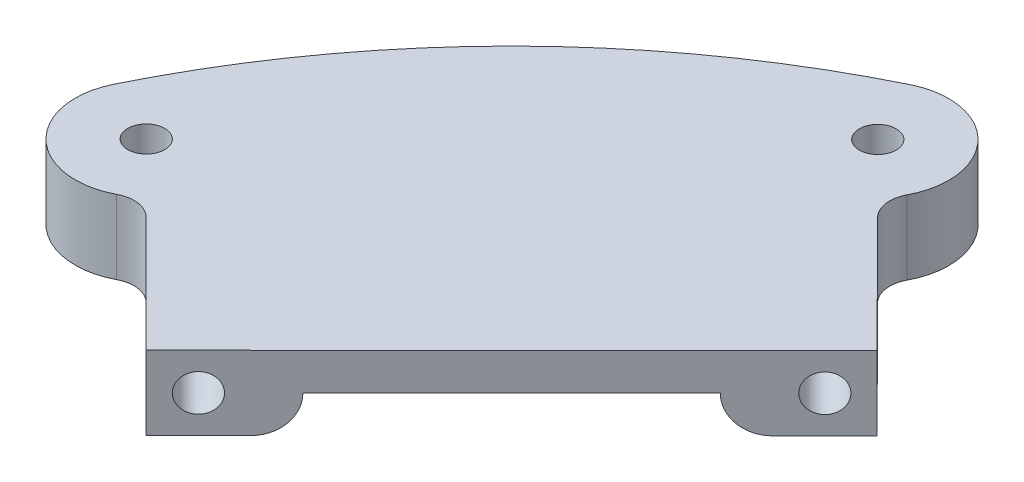
ISO-10303-21;
HEADER;
FILE_DESCRIPTION(('STEP AP214'),'2;1');
FILE_NAME('part.step','',(''),(''),'','','');
FILE_SCHEMA(('AUTOMOTIVE_DESIGN { 1 0 10303 214 1 1 1 1 }'));
ENDSEC;
DATA;
#1=APPLICATION_CONTEXT('core data for automotive mechanical design processes');
#2=APPLICATION_PROTOCOL_DEFINITION('international standard','automotive_design',2000,#1);
#3=PRODUCT_CONTEXT('',#1,'mechanical');
#4=PRODUCT('Part','Part','',(#3));
#5=PRODUCT_RELATED_PRODUCT_CATEGORY('part','',(#4));
#6=PRODUCT_DEFINITION_FORMATION('','',#4);
#7=PRODUCT_DEFINITION_CONTEXT('part definition',#1,'design');
#8=PRODUCT_DEFINITION('design','',#6,#7);
#9=PRODUCT_DEFINITION_SHAPE('','',#8);
#10=(LENGTH_UNIT() NAMED_UNIT(*) SI_UNIT(.MILLI.,.METRE.));
#11=(NAMED_UNIT(*) PLANE_ANGLE_UNIT() SI_UNIT($,.RADIAN.));
#12=(NAMED_UNIT(*) SI_UNIT($,.STERADIAN.) SOLID_ANGLE_UNIT());
#13=UNCERTAINTY_MEASURE_WITH_UNIT(LENGTH_MEASURE(1.E-05),#10,'distance_accuracy_value','');
#14=(GEOMETRIC_REPRESENTATION_CONTEXT(3) GLOBAL_UNCERTAINTY_ASSIGNED_CONTEXT((#13)) GLOBAL_UNIT_ASSIGNED_CONTEXT((#10,
#11,#12)) REPRESENTATION_CONTEXT('',''));
#15=CARTESIAN_POINT('',(0.,0.,0.));
#16=DIRECTION('',(0.,0.,1.));
#17=DIRECTION('',(1.,0.,0.));
#18=AXIS2_PLACEMENT_3D('',#15,#16,#17);
#19=CARTESIAN_POINT('',(-7.54395283776638,12.7,5.9740681448001));
#20=DIRECTION('',(-0.706369472249059,0.,-0.707843322123326));
#21=DIRECTION('',(-0.707843322123326,0.,0.706369472249059));
#22=AXIS2_PLACEMENT_3D('',#19,#20,#21);
#23=PLANE('',#22);
#24=CARTESIAN_POINT('',(-61.4301468246346,6.35,59.7480619346049));
#25=DIRECTION('',(0.706369472249059,0.,0.707843322123325));
#26=DIRECTION('',(0.707843322123326,0.,-0.706369472249059));
#27=AXIS2_PLACEMENT_3D('',#24,#25,#26);
#28=CIRCLE('',#27,6.35);
#29=CARTESIAN_POINT('',(-61.4301468246346,0.,59.7480619346049));
#30=VERTEX_POINT('',#29);
#31=CARTESIAN_POINT('',(-56.9353417291515,6.35,55.2626157858234));
#32=VERTEX_POINT('',#31);
#33=EDGE_CURVE('E339',#30,#32,#28,.T.);
#34=ORIENTED_EDGE('',*,*,#33,.T.);
#35=DIRECTION('',(0.707843322123326,0.,-0.706369472249059));
#36=VECTOR('',#35,1.);
#37=CARTESIAN_POINT('',(-0.777086763688398,6.35,-0.778708166189429));
#38=LINE('',#37,#36);
#39=CARTESIAN_POINT('',(-21.0283681242157,6.35,19.4304065911447));
#40=VERTEX_POINT('',#39);
#41=EDGE_CURVE('E174',#32,#40,#38,.T.);
#42=ORIENTED_EDGE('',*,*,#41,.T.);
#43=CARTESIAN_POINT('',(-16.5335630287326,6.35,14.9449604423631));
#44=DIRECTION('',(0.706369472249059,0.,0.707843322123325));
#45=DIRECTION('',(0.707843322123326,0.,-0.706369472249059));
#46=AXIS2_PLACEMENT_3D('',#43,#44,#45);
#47=CIRCLE('',#46,6.35);
#48=CARTESIAN_POINT('',(-16.5335630287326,0.,14.9449604423631));
#49=VERTEX_POINT('',#48);
#50=EDGE_CURVE('E157',#49,#40,#47,.F.);
#51=ORIENTED_EDGE('',*,*,#50,.F.);
#52=DIRECTION('',(0.707843322123326,0.,-0.706369472249059));
#53=VECTOR('',#52,1.);
#54=CARTESIAN_POINT('',(-7.54395283776638,0.,5.9740681448001));
#55=LINE('',#54,#53);
#56=CARTESIAN_POINT('',(-7.54395283776638,0.,5.9740681448001));
#57=VERTEX_POINT('',#56);
#58=EDGE_CURVE('E171',#49,#57,#55,.T.);
#59=ORIENTED_EDGE('',*,*,#58,.T.);
#60=DIRECTION('',(0.,-1.,0.));
#61=VECTOR('',#60,1.);
#62=CARTESIAN_POINT('',(-7.54395283776638,12.7,5.9740681448001));
#63=LINE('',#62,#61);
#64=CARTESIAN_POINT('',(-7.54395283776638,12.7,5.9740681448001));
#65=VERTEX_POINT('',#64);
#66=EDGE_CURVE('E229',#65,#57,#63,.T.);
#67=ORIENTED_EDGE('',*,*,#66,.F.);
#68=DIRECTION('',(0.707843322123326,0.,-0.706369472249059));
#69=VECTOR('',#68,1.);
#70=CARTESIAN_POINT('',(-7.54395283776638,12.7,5.9740681448001));
#71=LINE('',#70,#69);
#72=CARTESIAN_POINT('',(-70.4197570156008,12.7,68.718954232168));
#73=VERTEX_POINT('',#72);
#74=EDGE_CURVE('E396',#73,#65,#71,.T.);
#75=ORIENTED_EDGE('',*,*,#74,.F.);
#76=DIRECTION('',(0.,-1.,0.));
#77=VECTOR('',#76,1.);
#78=CARTESIAN_POINT('',(-70.4197570156008,12.7,68.718954232168));
#79=LINE('',#78,#77);
#80=CARTESIAN_POINT('',(-70.4197570156008,0.,68.718954232168));
#81=VERTEX_POINT('',#80);
#82=EDGE_CURVE('E232',#73,#81,#79,.T.);
#83=ORIENTED_EDGE('',*,*,#82,.T.);
#84=EDGE_CURVE('E183',#81,#30,#55,.T.);
#85=ORIENTED_EDGE('',*,*,#84,.T.);
#86=EDGE_LOOP('',(#34,#42,#51,#59,#67,#75,#83,#85));
#87=FACE_BOUND('',#86,.T.);
#88=CARTESIAN_POINT('',(-12.0387579332495,6.35,10.4595142935816));
#89=DIRECTION('',(-0.706369472249059,0.,-0.707843322123326));
#90=DIRECTION('',(-0.707843322123326,0.,0.706369472249059));
#91=AXIS2_PLACEMENT_3D('',#88,#89,#90);
#92=CIRCLE('',#91,3.175);
#93=CARTESIAN_POINT('',(-14.286160480991,6.35,12.7022373679724));
#94=VERTEX_POINT('',#93);
#95=EDGE_CURVE('E364',#94,#94,#92,.T.);
#96=ORIENTED_EDGE('',*,*,#95,.T.);
#97=EDGE_LOOP('',(#96));
#98=FACE_BOUND('',#97,.T.);
#99=CARTESIAN_POINT('',(-65.9249519201177,6.35,64.2335080833864));
#100=DIRECTION('',(0.706369472249059,0.,0.707843322123325));
#101=DIRECTION('',(0.707843322123326,0.,-0.706369472249059));
#102=AXIS2_PLACEMENT_3D('',#99,#100,#101);
#103=CIRCLE('',#102,3.175);
#104=CARTESIAN_POINT('',(-63.6775493723762,6.35,61.9907850089957));
#105=VERTEX_POINT('',#104);
#106=EDGE_CURVE('E360',#105,#105,#103,.T.);
#107=ORIENTED_EDGE('',*,*,#106,.F.);
#108=EDGE_LOOP('',(#107));
#109=FACE_BOUND('',#108,.T.);
#110=ADVANCED_FACE('F38',(#87,#98,#109),#23,.F.);
#111=CARTESIAN_POINT('',(-101.843613636536,12.7,37.2809985615729));
#112=DIRECTION('',(0.,1.,0.));
#113=DIRECTION('',(0.,0.,1.));
#114=AXIS2_PLACEMENT_3D('',#111,#112,#113);
#115=PLANE('',#114);
#116=CARTESIAN_POINT('',(-101.843613636536,12.7,37.2809985615729));
#117=DIRECTION('',(0.,1.,0.));
#118=DIRECTION('',(0.,0.,1.));
#119=AXIS2_PLACEMENT_3D('',#116,#117,#118);
#120=CIRCLE('',#119,3.17500000000014);
#121=CARTESIAN_POINT('',(-101.843613636536,12.7,40.455998561573));
#122=VERTEX_POINT('',#121);
#123=EDGE_CURVE('E379',#122,#122,#120,.T.);
#124=ORIENTED_EDGE('',*,*,#123,.F.);
#125=EDGE_LOOP('',(#124));
#126=FACE_BOUND('',#125,.T.);
#127=CARTESIAN_POINT('',(-101.843613636536,12.7,37.2809985615729));
#128=DIRECTION('',(0.,1.,0.));
#129=DIRECTION('',(0.,0.,1.));
#130=AXIS2_PLACEMENT_3D('',#127,#128,#129);
#131=CIRCLE('',#130,12.1889368392396);
#132=CARTESIAN_POINT('',(-112.854196124688,12.7,32.0524945171473));
#133=VERTEX_POINT('',#132);
#134=CARTESIAN_POINT('',(-96.1439027407809,12.7,48.0552028002061));
#135=VERTEX_POINT('',#134);
#136=EDGE_CURVE('E207',#133,#135,#131,.T.);
#137=ORIENTED_EDGE('',*,*,#136,.T.);
#138=CARTESIAN_POINT('',(-93.7684263778857,12.7,52.5455827450801));
#139=DIRECTION('',(0.,-1.,0.));
#140=DIRECTION('',(0.,0.,-1.));
#141=AXIS2_PLACEMENT_3D('',#138,#139,#140);
#142=CIRCLE('',#141,5.08000000000004);
#143=CARTESIAN_POINT('',(-90.1755144575095,12.7,48.9542899510546));
#144=VERTEX_POINT('',#143);
#145=EDGE_CURVE('E390',#135,#144,#142,.T.);
#146=ORIENTED_EDGE('',*,*,#145,.T.);
#147=DIRECTION('',(0.706947400398703,0.,0.707266126058301));
#148=VECTOR('',#147,1.);
#149=CARTESIAN_POINT('',(-90.1755144575095,12.7,48.9542899510546));
#150=LINE('',#149,#148);
#151=EDGE_CURVE('E393',#144,#73,#150,.T.);
#152=ORIENTED_EDGE('',*,*,#151,.T.);
#153=ORIENTED_EDGE('',*,*,#74,.T.);
#154=DIRECTION('',(-0.705791072840609,0.,-0.708420045946261));
#155=VECTOR('',#154,1.);
#156=CARTESIAN_POINT('',(-27.2673965223174,12.7,-13.8228426109464));
#157=LINE('',#156,#155);
#158=CARTESIAN_POINT('',(-27.2673965223174,12.7,-13.8228426109464));
#159=VERTEX_POINT('',#158);
#160=EDGE_CURVE('E399',#65,#159,#157,.T.);
#161=ORIENTED_EDGE('',*,*,#160,.T.);
#162=CARTESIAN_POINT('',(-23.6686226889104,12.7,-17.4082612609767));
#163=DIRECTION('',(0.,-1.,0.));
#164=DIRECTION('',(0.,0.,1.));
#165=AXIS2_PLACEMENT_3D('',#162,#163,#164);
#166=CIRCLE('',#165,5.07999999999999);
#167=CARTESIAN_POINT('',(-28.1540415855256,12.7,-19.7930919304138));
#168=VERTEX_POINT('',#167);
#169=EDGE_CURVE('E402',#159,#168,#166,.T.);
#170=ORIENTED_EDGE('',*,*,#169,.T.);
#171=CARTESIAN_POINT('',(-38.9163422997725,12.7,-25.5152475213685));
#172=DIRECTION('',(0.,1.,0.));
#173=DIRECTION('',(0.,0.,-1.));
#174=AXIS2_PLACEMENT_3D('',#171,#172,#173);
#175=CIRCLE('',#174,12.1889368392396);
#176=CARTESIAN_POINT('',(-44.1218852183505,12.7,-36.5367040582249));
#177=VERTEX_POINT('',#176);
#178=EDGE_CURVE('E405',#168,#177,#175,.T.);
#179=ORIENTED_EDGE('',*,*,#178,.T.);
#180=CARTESIAN_POINT('',(21.1376983967457,12.7,97.6619821178486));
#181=DIRECTION('',(0.,1.,0.));
#182=DIRECTION('',(0.,0.,-1.));
#183=AXIS2_PLACEMENT_3D('',#180,#181,#182);
#184=CIRCLE('',#183,149.225);
#185=CARTESIAN_POINT('',(-84.2350416557578,12.7,-8.00109695345003));
#186=VERTEX_POINT('',#185);
#187=EDGE_CURVE('E408',#177,#186,#184,.T.);
#188=ORIENTED_EDGE('',*,*,#187,.T.);
#189=CARTESIAN_POINT('',(21.2081755529898,12.7,97.5916517069995));
#190=DIRECTION('',(0.,1.,0.));
#191=DIRECTION('',(0.,0.,1.));
#192=AXIS2_PLACEMENT_3D('',#189,#190,#191);
#193=CIRCLE('',#192,149.225);
#194=EDGE_CURVE('E213',#186,#133,#193,.T.);
#195=ORIENTED_EDGE('',*,*,#194,.T.);
#196=EDGE_LOOP('',(#137,#146,#152,#153,#161,#170,#179,#188,#195));
#197=FACE_BOUND('',#196,.T.);
#198=CARTESIAN_POINT('',(-38.9163422997725,12.7,-25.5152475213685));
#199=DIRECTION('',(0.,1.,0.));
#200=DIRECTION('',(0.,0.,-1.));
#201=AXIS2_PLACEMENT_3D('',#198,#199,#200);
#202=CIRCLE('',#201,3.17500000001043);
#203=CARTESIAN_POINT('',(-38.9163422997725,12.7,-28.6902475213789));
#204=VERTEX_POINT('',#203);
#205=EDGE_CURVE('E371',#204,#204,#202,.T.);
#206=ORIENTED_EDGE('',*,*,#205,.F.);
#207=EDGE_LOOP('',(#206));
#208=FACE_BOUND('',#207,.T.);
#209=ADVANCED_FACE('F278',(#126,#197,#208),#115,.T.);
#210=CARTESIAN_POINT('',(-101.843613636536,0.,37.2809985615729));
#211=DIRECTION('',(0.,1.,0.));
#212=DIRECTION('',(0.,0.,1.));
#213=AXIS2_PLACEMENT_3D('',#210,#211,#212);
#214=PLANE('',#213);
#215=DIRECTION('',(0.707843322123326,0.,-0.706369472249059));
#216=VECTOR('',#215,1.);
#217=CARTESIAN_POINT('',(-36.6606559539406,0.,-36.7371489300544));
#218=LINE('',#217,#216);
#219=CARTESIAN_POINT('',(-92.2883711453305,0.,18.7747399216949));
#220=VERTEX_POINT('',#219);
#221=CARTESIAN_POINT('',(-57.4424770885411,0.,-15.9985990724567));
#222=VERTEX_POINT('',#221);
#223=EDGE_CURVE('E165',#220,#222,#218,.T.);
#224=ORIENTED_EDGE('',*,*,#223,.F.);
#225=CARTESIAN_POINT('',(-92.2883711453305,0.,18.7747399216949));
#226=CARTESIAN_POINT('',(-92.4218469027018,0.,18.9079607344967));
#227=CARTESIAN_POINT('',(-92.5485967866194,0.,19.0476025305012));
#228=CARTESIAN_POINT('',(-92.7889904489911,0.,19.3373076905955));
#229=CARTESIAN_POINT('',(-92.9026598681083,0.,19.4873497092292));
#230=CARTESIAN_POINT('',(-93.2217112059064,0.,19.9451236542563));
#231=CARTESIAN_POINT('',(-93.4095579795355,0.,20.2651113442281));
#232=CARTESIAN_POINT('',(-93.7600622221624,0.,20.9566332135837));
#233=CARTESIAN_POINT('',(-93.9186232147493,0.,21.3301751730085));
#234=CARTESIAN_POINT('',(-94.1972071470198,0.,22.0915645610845));
#235=CARTESIAN_POINT('',(-94.3171719588188,0.,22.4794325953181));
#236=CARTESIAN_POINT('',(-94.5300370984474,0.,23.2660027307276));
#237=CARTESIAN_POINT('',(-94.622682678036,0.,23.6647711114443));
#238=CARTESIAN_POINT('',(-94.7904172252263,0.,24.4656298052867));
#239=CARTESIAN_POINT('',(-94.8655140843054,0.,24.8677185407353));
#240=CARTESIAN_POINT('',(-94.9817951703179,0.,25.5205420231663));
#241=CARTESIAN_POINT('',(-95.0250517553798,0.,25.7709265747916));
#242=CARTESIAN_POINT('',(-95.0691853333359,0.,26.0265536911415));
#243=CARTESIAN_POINT('',(-95.0700891369479,0.,26.0317887041317));
#244=CARTESIAN_POINT('',(-95.0709929404961,0.,26.0370237184815));
#245=B_SPLINE_CURVE_WITH_KNOTS('',3,(#225,#226,#227,#228,#229,#230,#231,#232,#233,#234,#235,
#236,#237,#238,#239,#240,#241,#242,#243,#244),.UNSPECIFIED.,.F.,.F.,(4,2,2,2,2,2,2,2,2,4),(0.,
0.565172013320262,1.12921657797543,2.23838440307382,3.45307205526979,4.66958061942638,
5.89709813848719,7.12406258880606,7.88635220286167,7.90228958031221),.UNSPECIFIED.);
#246=CARTESIAN_POINT('',(-95.0709929404961,0.,26.0370237184815));
#247=VERTEX_POINT('',#246);
#248=EDGE_CURVE('E11',#220,#247,#245,.T.);
#249=ORIENTED_EDGE('',*,*,#248,.T.);
#250=DIRECTION('',(0.706369472249059,0.,0.707843322123326));
#251=VECTOR('',#250,1.);
#252=CARTESIAN_POINT('',(-97.3137160148868,0.,23.78962117074));
#253=LINE('',#252,#251);
#254=EDGE_CURVE('E346',#247,#30,#253,.T.);
#255=ORIENTED_EDGE('',*,*,#254,.T.);
#256=ORIENTED_EDGE('',*,*,#84,.F.);
#257=DIRECTION('',(0.706947400398703,0.,0.707266126058301));
#258=VECTOR('',#257,1.);
#259=CARTESIAN_POINT('',(-90.1755144575095,0.,48.9542899510546));
#260=LINE('',#259,#258);
#261=CARTESIAN_POINT('',(-90.1755144575095,0.,48.9542899510546));
#262=VERTEX_POINT('',#261);
#263=EDGE_CURVE('E184',#262,#81,#260,.T.);
#264=ORIENTED_EDGE('',*,*,#263,.F.);
#265=CARTESIAN_POINT('',(-93.7684263778857,0.,52.5455827450801));
#266=DIRECTION('',(0.,-1.,0.));
#267=DIRECTION('',(0.,0.,-1.));
#268=AXIS2_PLACEMENT_3D('',#265,#266,#267);
#269=CIRCLE('',#268,5.08000000000004);
#270=CARTESIAN_POINT('',(-96.1439027407809,0.,48.0552028002061));
#271=VERTEX_POINT('',#270);
#272=EDGE_CURVE('E189',#271,#262,#269,.T.);
#273=ORIENTED_EDGE('',*,*,#272,.F.);
#274=CARTESIAN_POINT('',(-101.843613636536,0.,37.2809985615729));
#275=DIRECTION('',(0.,1.,0.));
#276=DIRECTION('',(0.,0.,1.));
#277=AXIS2_PLACEMENT_3D('',#274,#275,#276);
#278=CIRCLE('',#277,12.1889368392396);
#279=CARTESIAN_POINT('',(-112.854196124688,0.,32.0524945171473));
#280=VERTEX_POINT('',#279);
#281=EDGE_CURVE('E383',#280,#271,#278,.T.);
#282=ORIENTED_EDGE('',*,*,#281,.F.);
#283=CARTESIAN_POINT('',(21.2081755529898,0.,97.5916517069995));
#284=DIRECTION('',(0.,1.,0.));
#285=DIRECTION('',(0.,0.,1.));
#286=AXIS2_PLACEMENT_3D('',#283,#284,#285);
#287=CIRCLE('',#286,149.225);
#288=CARTESIAN_POINT('',(-84.2350416557578,0.,-8.00109695345003));
#289=VERTEX_POINT('',#288);
#290=EDGE_CURVE('E204',#289,#280,#287,.T.);
#291=ORIENTED_EDGE('',*,*,#290,.F.);
#292=CARTESIAN_POINT('',(21.1376983967457,0.,97.6619821178486));
#293=DIRECTION('',(0.,1.,0.));
#294=DIRECTION('',(0.,0.,-1.));
#295=AXIS2_PLACEMENT_3D('',#292,#293,#294);
#296=CIRCLE('',#295,149.225);
#297=CARTESIAN_POINT('',(-44.1218852183505,0.,-36.5367040582249));
#298=VERTEX_POINT('',#297);
#299=EDGE_CURVE('E201',#298,#289,#296,.T.);
#300=ORIENTED_EDGE('',*,*,#299,.F.);
#301=CARTESIAN_POINT('',(-38.9163422997725,0.,-25.5152475213685));
#302=DIRECTION('',(0.,1.,0.));
#303=DIRECTION('',(0.,0.,-1.));
#304=AXIS2_PLACEMENT_3D('',#301,#302,#303);
#305=CIRCLE('',#304,12.1889368392396);
#306=CARTESIAN_POINT('',(-28.1540415855256,0.,-19.7930919304138));
#307=VERTEX_POINT('',#306);
#308=EDGE_CURVE('E198',#307,#298,#305,.T.);
#309=ORIENTED_EDGE('',*,*,#308,.F.);
#310=CARTESIAN_POINT('',(-23.6686226889104,0.,-17.4082612609767));
#311=DIRECTION('',(0.,-1.,0.));
#312=DIRECTION('',(0.,0.,1.));
#313=AXIS2_PLACEMENT_3D('',#310,#311,#312);
#314=CIRCLE('',#313,5.07999999999999);
#315=CARTESIAN_POINT('',(-27.2673965223174,0.,-13.8228426109464));
#316=VERTEX_POINT('',#315);
#317=EDGE_CURVE('E195',#316,#307,#314,.T.);
#318=ORIENTED_EDGE('',*,*,#317,.F.);
#319=DIRECTION('',(-0.705791072840609,0.,-0.708420045946261));
#320=VECTOR('',#319,1.);
#321=CARTESIAN_POINT('',(-27.2673965223174,0.,-13.8228426109464));
#322=LINE('',#321,#320);
#323=EDGE_CURVE('E181',#57,#316,#322,.T.);
#324=ORIENTED_EDGE('',*,*,#323,.F.);
#325=ORIENTED_EDGE('',*,*,#58,.F.);
#326=DIRECTION('',(0.706369472249059,0.,0.707843322123326));
#327=VECTOR('',#326,1.);
#328=CARTESIAN_POINT('',(-52.4171322189848,0.,-21.0134803215018));
#329=LINE('',#328,#327);
#330=CARTESIAN_POINT('',(-50.174409144594,0.,-18.7660777737602));
#331=VERTEX_POINT('',#330);
#332=EDGE_CURVE('E153',#331,#49,#329,.T.);
#333=ORIENTED_EDGE('',*,*,#332,.F.);
#334=CARTESIAN_POINT('',(-57.4424770885411,0.,-15.9985990724567));
#335=CARTESIAN_POINT('',(-57.3089783566202,0.,-16.1317968627714));
#336=CARTESIAN_POINT('',(-57.1690726744335,0.,-16.2582554107475));
#337=CARTESIAN_POINT('',(-56.8788670821581,0.,-16.4980447076421));
#338=CARTESIAN_POINT('',(-56.7285884640354,0.,-16.6114011416592));
#339=CARTESIAN_POINT('',(-56.2701505027802,0.,-16.9294976310727));
#340=CARTESIAN_POINT('',(-55.9497719718494,0.,-17.1166770343617));
#341=CARTESIAN_POINT('',(-55.2575210355559,0.,-17.4657391507519));
#342=CARTESIAN_POINT('',(-54.8836493929523,0.,-17.6235212114498));
#343=CARTESIAN_POINT('',(-54.1216809958962,0.,-17.9005175462327));
#344=CARTESIAN_POINT('',(-53.7335637570644,0.,-18.0196736496102));
#345=CARTESIAN_POINT('',(-52.9465516475076,0.,-18.2308988493339));
#346=CARTESIAN_POINT('',(-52.547591028367,0.,-18.3227130598435));
#347=CARTESIAN_POINT('',(-51.7463844587967,0.,-18.4887779829923));
#348=CARTESIAN_POINT('',(-51.3441400695919,0.,-18.5630365903803));
#349=CARTESIAN_POINT('',(-50.6910756362336,0.,-18.6779567194231));
#350=CARTESIAN_POINT('',(-50.4406014671843,0.,-18.7206913246386));
#351=CARTESIAN_POINT('',(-50.1848829168537,0.,-18.7642919935951));
#352=CARTESIAN_POINT('',(-50.1796460314036,0.,-18.765184883711));
#353=CARTESIAN_POINT('',(-50.174409144594,0.,-18.7660777737602));
#354=B_SPLINE_CURVE_WITH_KNOTS('',3,(#334,#335,#336,#337,#338,#339,#340,#341,#342,#343,#344,
#345,#346,#347,#348,#349,#350,#351,#352,#353),.UNSPECIFIED.,.F.,.F.,(4,2,2,2,2,2,2,2,2,4),(0.,
0.565172013318895,1.12921657797294,2.23838440307383,3.45307205527039,4.66958061942838,
5.89709813848845,7.12406258880593,7.88635220286168,7.90228958031223),.UNSPECIFIED.);
#355=EDGE_CURVE('E54',#331,#222,#354,.F.);
#356=ORIENTED_EDGE('',*,*,#355,.T.);
#357=EDGE_LOOP('',(#224,#249,#255,#256,#264,#273,#282,#291,#300,#309,#318,#324,#325,#333,#356));
#358=FACE_BOUND('',#357,.T.);
#359=CARTESIAN_POINT('',(-101.843613636536,0.,37.2809985615729));
#360=DIRECTION('',(0.,1.,0.));
#361=DIRECTION('',(0.,0.,1.));
#362=AXIS2_PLACEMENT_3D('',#359,#360,#361);
#363=CIRCLE('',#362,3.17500000000014);
#364=CARTESIAN_POINT('',(-101.843613636536,0.,40.455998561573));
#365=VERTEX_POINT('',#364);
#366=EDGE_CURVE('E375',#365,#365,#363,.T.);
#367=ORIENTED_EDGE('',*,*,#366,.T.);
#368=EDGE_LOOP('',(#367));
#369=FACE_BOUND('',#368,.T.);
#370=CARTESIAN_POINT('',(-38.9163422997725,0.,-25.5152475213685));
#371=DIRECTION('',(0.,1.,0.));
#372=DIRECTION('',(0.,0.,-1.));
#373=AXIS2_PLACEMENT_3D('',#370,#371,#372);
#374=CIRCLE('',#373,3.17500000001043);
#375=CARTESIAN_POINT('',(-38.9163422997725,0.,-28.6902475213789));
#376=VERTEX_POINT('',#375);
#377=EDGE_CURVE('E359',#376,#376,#374,.T.);
#378=ORIENTED_EDGE('',*,*,#377,.T.);
#379=EDGE_LOOP('',(#378));
#380=FACE_BOUND('',#379,.T.);
#381=ADVANCED_FACE('F178',(#358,#369,#380),#214,.F.);
#382=CARTESIAN_POINT('',(-101.843613636536,12.7,37.2809985615729));
#383=DIRECTION('',(0.,-1.,0.));
#384=DIRECTION('',(0.,0.,-1.));
#385=AXIS2_PLACEMENT_3D('',#382,#383,#384);
#386=CYLINDRICAL_SURFACE('',#385,12.1889368392396);
#387=ORIENTED_EDGE('',*,*,#281,.T.);
#388=DIRECTION('',(0.,-1.,0.));
#389=VECTOR('',#388,1.);
#390=CARTESIAN_POINT('',(-96.1439027407809,12.7,48.0552028002061));
#391=LINE('',#390,#389);
#392=EDGE_CURVE('E240',#135,#271,#391,.T.);
#393=ORIENTED_EDGE('',*,*,#392,.F.);
#394=ORIENTED_EDGE('',*,*,#136,.F.);
#395=DIRECTION('',(0.,-1.,0.));
#396=VECTOR('',#395,1.);
#397=CARTESIAN_POINT('',(-112.854196124688,12.7,32.0524945171473));
#398=LINE('',#397,#396);
#399=EDGE_CURVE('E208',#133,#280,#398,.T.);
#400=ORIENTED_EDGE('',*,*,#399,.T.);
#401=EDGE_LOOP('',(#387,#393,#394,#400));
#402=FACE_BOUND('',#401,.T.);
#403=ADVANCED_FACE('F277',(#402),#386,.T.);
#404=CARTESIAN_POINT('',(-93.7684263778857,12.7,52.5455827450801));
#405=DIRECTION('',(0.,-1.,0.));
#406=DIRECTION('',(0.,0.,-1.));
#407=AXIS2_PLACEMENT_3D('',#404,#405,#406);
#408=CYLINDRICAL_SURFACE('',#407,5.08000000000004);
#409=ORIENTED_EDGE('',*,*,#272,.T.);
#410=DIRECTION('',(0.,-1.,0.));
#411=VECTOR('',#410,1.);
#412=CARTESIAN_POINT('',(-90.1755144575095,12.7,48.9542899510546));
#413=LINE('',#412,#411);
#414=EDGE_CURVE('E236',#144,#262,#413,.T.);
#415=ORIENTED_EDGE('',*,*,#414,.F.);
#416=ORIENTED_EDGE('',*,*,#145,.F.);
#417=ORIENTED_EDGE('',*,*,#392,.T.);
#418=EDGE_LOOP('',(#409,#415,#416,#417));
#419=FACE_BOUND('',#418,.T.);
#420=ADVANCED_FACE('F307',(#419),#408,.F.);
#421=CARTESIAN_POINT('',(-90.1755144575095,12.7,48.9542899510546));
#422=DIRECTION('',(0.7072661260583,0.,-0.706947400398703));
#423=DIRECTION('',(-0.706947400398703,0.,-0.707266126058301));
#424=AXIS2_PLACEMENT_3D('',#421,#422,#423);
#425=PLANE('',#424);
#426=ORIENTED_EDGE('',*,*,#263,.T.);
#427=ORIENTED_EDGE('',*,*,#82,.F.);
#428=ORIENTED_EDGE('',*,*,#151,.F.);
#429=ORIENTED_EDGE('',*,*,#414,.T.);
#430=EDGE_LOOP('',(#426,#427,#428,#429));
#431=FACE_BOUND('',#430,.T.);
#432=ADVANCED_FACE('F301',(#431),#425,.F.);
#433=CARTESIAN_POINT('',(-27.2673965223174,12.7,-13.8228426109464));
#434=DIRECTION('',(-0.708420045946261,0.,0.705791072840609));
#435=DIRECTION('',(0.705791072840609,0.,0.708420045946261));
#436=AXIS2_PLACEMENT_3D('',#433,#434,#435);
#437=PLANE('',#436);
#438=ORIENTED_EDGE('',*,*,#323,.T.);
#439=DIRECTION('',(0.,-1.,0.));
#440=VECTOR('',#439,1.);
#441=CARTESIAN_POINT('',(-27.2673965223174,12.7,-13.8228426109464));
#442=LINE('',#441,#440);
#443=EDGE_CURVE('E225',#159,#316,#442,.T.);
#444=ORIENTED_EDGE('',*,*,#443,.F.);
#445=ORIENTED_EDGE('',*,*,#160,.F.);
#446=ORIENTED_EDGE('',*,*,#66,.T.);
#447=EDGE_LOOP('',(#438,#444,#445,#446));
#448=FACE_BOUND('',#447,.T.);
#449=ADVANCED_FACE('F297',(#448),#437,.F.);
#450=CARTESIAN_POINT('',(-23.6686226889104,12.7,-17.4082612609767));
#451=DIRECTION('',(0.,-1.,0.));
#452=DIRECTION('',(0.,0.,-1.));
#453=AXIS2_PLACEMENT_3D('',#450,#451,#452);
#454=CYLINDRICAL_SURFACE('',#453,5.07999999999999);
#455=ORIENTED_EDGE('',*,*,#317,.T.);
#456=DIRECTION('',(0.,-1.,0.));
#457=VECTOR('',#456,1.);
#458=CARTESIAN_POINT('',(-28.1540415855256,12.7,-19.7930919304138));
#459=LINE('',#458,#457);
#460=EDGE_CURVE('E221',#168,#307,#459,.T.);
#461=ORIENTED_EDGE('',*,*,#460,.F.);
#462=ORIENTED_EDGE('',*,*,#169,.F.);
#463=ORIENTED_EDGE('',*,*,#443,.T.);
#464=EDGE_LOOP('',(#455,#461,#462,#463));
#465=FACE_BOUND('',#464,.T.);
#466=ADVANCED_FACE('F293',(#465),#454,.F.);
#467=CARTESIAN_POINT('',(-38.9163422997725,12.7,-25.5152475213685));
#468=DIRECTION('',(0.,-1.,0.));
#469=DIRECTION('',(0.,0.,-1.));
#470=AXIS2_PLACEMENT_3D('',#467,#468,#469);
#471=CYLINDRICAL_SURFACE('',#470,12.1889368392396);
#472=ORIENTED_EDGE('',*,*,#308,.T.);
#473=DIRECTION('',(0.,-1.,0.));
#474=VECTOR('',#473,1.);
#475=CARTESIAN_POINT('',(-44.1218852183505,12.7,-36.5367040582249));
#476=LINE('',#475,#474);
#477=EDGE_CURVE('E217',#177,#298,#476,.T.);
#478=ORIENTED_EDGE('',*,*,#477,.F.);
#479=ORIENTED_EDGE('',*,*,#178,.F.);
#480=ORIENTED_EDGE('',*,*,#460,.T.);
#481=EDGE_LOOP('',(#472,#478,#479,#480));
#482=FACE_BOUND('',#481,.T.);
#483=ADVANCED_FACE('F289',(#482),#471,.T.);
#484=CARTESIAN_POINT('',(21.1376983967457,12.7,97.6619821178486));
#485=DIRECTION('',(0.,-1.,0.));
#486=DIRECTION('',(0.,0.,-1.));
#487=AXIS2_PLACEMENT_3D('',#484,#485,#486);
#488=CYLINDRICAL_SURFACE('',#487,149.225);
#489=ORIENTED_EDGE('',*,*,#299,.T.);
#490=DIRECTION('',(0.,-1.,0.));
#491=VECTOR('',#490,1.);
#492=CARTESIAN_POINT('',(-84.2350416557578,12.7,-8.00109695345003));
#493=LINE('',#492,#491);
#494=EDGE_CURVE('E212',#186,#289,#493,.T.);
#495=ORIENTED_EDGE('',*,*,#494,.F.);
#496=ORIENTED_EDGE('',*,*,#187,.F.);
#497=ORIENTED_EDGE('',*,*,#477,.T.);
#498=EDGE_LOOP('',(#489,#495,#496,#497));
#499=FACE_BOUND('',#498,.T.);
#500=ADVANCED_FACE('F285',(#499),#488,.T.);
#501=CARTESIAN_POINT('',(21.2081755529898,12.7,97.5916517069995));
#502=DIRECTION('',(0.,-1.,0.));
#503=DIRECTION('',(0.,0.,-1.));
#504=AXIS2_PLACEMENT_3D('',#501,#502,#503);
#505=CYLINDRICAL_SURFACE('',#504,149.225);
#506=ORIENTED_EDGE('',*,*,#290,.T.);
#507=ORIENTED_EDGE('',*,*,#399,.F.);
#508=ORIENTED_EDGE('',*,*,#194,.F.);
#509=ORIENTED_EDGE('',*,*,#494,.T.);
#510=EDGE_LOOP('',(#506,#507,#508,#509));
#511=FACE_BOUND('',#510,.T.);
#512=ADVANCED_FACE('F280',(#511),#505,.T.);
#513=CARTESIAN_POINT('',(-101.843613636536,12.7,37.2809985615729));
#514=DIRECTION('',(0.,-1.,0.));
#515=DIRECTION('',(0.,0.,-1.));
#516=AXIS2_PLACEMENT_3D('',#513,#514,#515);
#517=CYLINDRICAL_SURFACE('',#516,3.17500000000014);
#518=ORIENTED_EDGE('',*,*,#123,.T.);
#519=EDGE_LOOP('',(#518));
#520=FACE_BOUND('',#519,.T.);
#521=ORIENTED_EDGE('',*,*,#366,.F.);
#522=EDGE_LOOP('',(#521));
#523=FACE_BOUND('',#522,.T.);
#524=ADVANCED_FACE('F284',(#520,#523),#517,.F.);
#525=CARTESIAN_POINT('',(-38.9163422997725,12.7,-25.5152475213685));
#526=DIRECTION('',(0.,-1.,0.));
#527=DIRECTION('',(0.,0.,-1.));
#528=AXIS2_PLACEMENT_3D('',#525,#526,#527);
#529=CYLINDRICAL_SURFACE('',#528,3.17500000001043);
#530=ORIENTED_EDGE('',*,*,#205,.T.);
#531=EDGE_LOOP('',(#530));
#532=FACE_BOUND('',#531,.T.);
#533=ORIENTED_EDGE('',*,*,#377,.F.);
#534=EDGE_LOOP('',(#533));
#535=FACE_BOUND('',#534,.T.);
#536=ADVANCED_FACE('F445',(#532,#535),#529,.F.);
#537=CARTESIAN_POINT('',(-21.0096502308125,6.35,1.46990410261538));
#538=DIRECTION('',(0.706369472249059,0.,0.707843322123326));
#539=DIRECTION('',(0.707843322123326,0.,-0.706369472249059));
#540=AXIS2_PLACEMENT_3D('',#537,#538,#539);
#541=CYLINDRICAL_SURFACE('',#540,3.175);
#542=CARTESIAN_POINT('',(-21.0096502308125,6.35,1.46990410261538));
#543=DIRECTION('',(-0.706369472249059,0.,-0.707843322123326));
#544=DIRECTION('',(-0.707843322123326,0.,0.706369472249059));
#545=AXIS2_PLACEMENT_3D('',#542,#543,#544);
#546=CIRCLE('',#545,3.175);
#547=CARTESIAN_POINT('',(-23.2570527785541,6.35,3.71262717700615));
#548=VERTEX_POINT('',#547);
#549=EDGE_CURVE('E349',#548,#548,#546,.T.);
#550=ORIENTED_EDGE('',*,*,#549,.T.);
#551=EDGE_LOOP('',(#550));
#552=FACE_BOUND('',#551,.T.);
#553=ORIENTED_EDGE('',*,*,#95,.F.);
#554=EDGE_LOOP('',(#553));
#555=FACE_BOUND('',#554,.T.);
#556=ADVANCED_FACE('F448',(#552,#555),#541,.F.);
#557=CARTESIAN_POINT('',(-21.0096502308125,6.35,1.46990410261538));
#558=DIRECTION('',(-0.706369472249059,0.,-0.707843322123326));
#559=DIRECTION('',(-0.707843322123326,0.,0.706369472249059));
#560=AXIS2_PLACEMENT_3D('',#557,#558,#559);
#561=PLANE('',#560);
#562=ORIENTED_EDGE('',*,*,#549,.F.);
#563=EDGE_LOOP('',(#562));
#564=FACE_BOUND('',#563,.T.);
#565=ADVANCED_FACE('F456',(#564),#561,.F.);
#566=CARTESIAN_POINT('',(-74.8958442176808,6.35,55.2438978924202));
#567=DIRECTION('',(0.706369472249059,0.,0.707843322123326));
#568=DIRECTION('',(0.707843322123326,0.,-0.706369472249059));
#569=AXIS2_PLACEMENT_3D('',#566,#567,#568);
#570=CYLINDRICAL_SURFACE('',#569,3.175);
#571=CARTESIAN_POINT('',(-74.8958442176808,6.35,55.2438978924202));
#572=DIRECTION('',(0.706369472249059,0.,0.707843322123325));
#573=DIRECTION('',(0.707843322123326,0.,-0.706369472249059));
#574=AXIS2_PLACEMENT_3D('',#571,#572,#573);
#575=CIRCLE('',#574,3.175);
#576=CARTESIAN_POINT('',(-72.6484416699392,6.35,53.0011748180294));
#577=VERTEX_POINT('',#576);
#578=EDGE_CURVE('E355',#577,#577,#575,.T.);
#579=ORIENTED_EDGE('',*,*,#578,.F.);
#580=EDGE_LOOP('',(#579));
#581=FACE_BOUND('',#580,.T.);
#582=ORIENTED_EDGE('',*,*,#106,.T.);
#583=EDGE_LOOP('',(#582));
#584=FACE_BOUND('',#583,.T.);
#585=ADVANCED_FACE('F462',(#581,#584),#570,.F.);
#586=CARTESIAN_POINT('',(-9.74797906125145,0.,-9.76831835715566));
#587=DIRECTION('',(0.706369472249059,0.,0.707843322123325));
#588=DIRECTION('',(0.707843322123326,0.,-0.706369472249059));
#589=AXIS2_PLACEMENT_3D('',#586,#587,#588);
#590=PLANE('',#589);
#591=ORIENTED_EDGE('',*,*,#578,.T.);
#592=EDGE_LOOP('',(#591));
#593=FACE_BOUND('',#592,.T.);
#594=ADVANCED_FACE('F467',(#593),#590,.T.);
#595=CARTESIAN_POINT('',(-97.3137160148868,6.35,23.78962117074));
#596=DIRECTION('',(0.706369472249059,0.,0.707843322123326));
#597=DIRECTION('',(0.707843322123326,0.,-0.706369472249059));
#598=AXIS2_PLACEMENT_3D('',#595,#596,#597);
#599=CYLINDRICAL_SURFACE('',#598,6.35);
#600=ORIENTED_EDGE('',*,*,#254,.F.);
#601=CARTESIAN_POINT('',(-95.0709929404961,6.35,26.0370237184815));
#602=DIRECTION('',(0.706369472249059,0.,0.707843322123325));
#603=DIRECTION('',(0.707843322123326,0.,-0.706369472249059));
#604=AXIS2_PLACEMENT_3D('',#601,#602,#603);
#605=CIRCLE('',#604,6.35);
#606=CARTESIAN_POINT('',(-90.5761878450129,6.35,21.5515775697));
#607=VERTEX_POINT('',#606);
#608=EDGE_CURVE('E62',#247,#607,#605,.T.);
#609=ORIENTED_EDGE('',*,*,#608,.T.);
#610=DIRECTION('',(0.706369472249059,0.,0.707843322123326));
#611=VECTOR('',#610,1.);
#612=CARTESIAN_POINT('',(-92.8189109194037,6.35,19.3041750219585));
#613=LINE('',#612,#611);
#614=EDGE_CURVE('E350',#607,#32,#613,.T.);
#615=ORIENTED_EDGE('',*,*,#614,.T.);
#616=ORIENTED_EDGE('',*,*,#33,.F.);
#617=EDGE_LOOP('',(#600,#609,#615,#616));
#618=FACE_BOUND('',#617,.T.);
#619=ADVANCED_FACE('F471',(#618),#599,.T.);
#620=CARTESIAN_POINT('',(-36.6606559539406,6.35,-36.7371489300544));
#621=DIRECTION('',(0.,-1.,0.));
#622=DIRECTION('',(0.,0.,-1.));
#623=AXIS2_PLACEMENT_3D('',#620,#621,#622);
#624=PLANE('',#623);
#625=ORIENTED_EDGE('',*,*,#614,.F.);
#626=DIRECTION('',(0.707843322123325,0.,-0.706369472249059));
#627=VECTOR('',#626,1.);
#628=CARTESIAN_POINT('',(-54.6692142400771,6.35,-14.2806316249787));
#629=LINE('',#628,#627);
#630=CARTESIAN_POINT('',(-54.6692142400772,6.35,-14.2806316249787));
#631=VERTEX_POINT('',#630);
#632=EDGE_CURVE('E258',#607,#631,#629,.T.);
#633=ORIENTED_EDGE('',*,*,#632,.T.);
#634=DIRECTION('',(0.706369472249059,0.,0.707843322123326));
#635=VECTOR('',#634,1.);
#636=CARTESIAN_POINT('',(-56.9119373144679,6.35,-16.5280341727203));
#637=LINE('',#636,#635);
#638=EDGE_CURVE('E164',#631,#40,#637,.T.);
#639=ORIENTED_EDGE('',*,*,#638,.T.);
#640=ORIENTED_EDGE('',*,*,#41,.F.);
#641=EDGE_LOOP('',(#625,#633,#639,#640));
#642=FACE_BOUND('',#641,.T.);
#643=ADVANCED_FACE('F475',(#642),#624,.T.);
#644=CARTESIAN_POINT('',(-52.4171322189848,6.35,-21.0134803215018));
#645=DIRECTION('',(0.706369472249059,0.,0.707843322123326));
#646=DIRECTION('',(0.707843322123326,0.,-0.706369472249059));
#647=AXIS2_PLACEMENT_3D('',#644,#645,#646);
#648=CYLINDRICAL_SURFACE('',#647,6.35);
#649=ORIENTED_EDGE('',*,*,#638,.F.);
#650=CARTESIAN_POINT('',(-50.174409144594,6.35,-18.7660777737602));
#651=DIRECTION('',(0.706369472249059,0.,0.707843322123325));
#652=DIRECTION('',(0.707843322123326,0.,-0.706369472249059));
#653=AXIS2_PLACEMENT_3D('',#650,#651,#652);
#654=CIRCLE('',#653,6.35);
#655=EDGE_CURVE('E160',#631,#331,#654,.T.);
#656=ORIENTED_EDGE('',*,*,#655,.T.);
#657=ORIENTED_EDGE('',*,*,#332,.T.);
#658=ORIENTED_EDGE('',*,*,#50,.T.);
#659=EDGE_LOOP('',(#649,#656,#657,#658));
#660=FACE_BOUND('',#659,.T.);
#661=ADVANCED_FACE('F156',(#660),#648,.T.);
#662=CARTESIAN_POINT('',(-36.6606559539406,0.,-36.7371489300544));
#663=DIRECTION('',(0.706369472249059,0.,0.707843322123325));
#664=DIRECTION('',(0.707843322123326,0.,-0.706369472249059));
#665=AXIS2_PLACEMENT_3D('',#662,#663,#664);
#666=PLANE('',#665);
#667=ORIENTED_EDGE('',*,*,#223,.T.);
#668=CARTESIAN_POINT('',(-52.4171322189848,6.35,-21.0134803215018));
#669=DIRECTION('',(0.706369472249059,0.,0.707843322123325));
#670=DIRECTION('',(0.707843322123326,0.,-0.706369472249059));
#671=AXIS2_PLACEMENT_3D('',#668,#669,#670);
#672=CIRCLE('',#671,9.525);
#673=CARTESIAN_POINT('',(-58.7737465452407,3.175,-14.6701015446008));
#674=VERTEX_POINT('',#673);
#675=EDGE_CURVE('E250',#222,#674,#672,.F.);
#676=ORIENTED_EDGE('',*,*,#675,.T.);
#677=DIRECTION('',(0.707843322123326,0.,-0.706369472249059));
#678=VECTOR('',#677,1.);
#679=CARTESIAN_POINT('',(-92.8189109194037,3.175,19.3041750219585));
#680=LINE('',#679,#678);
#681=CARTESIAN_POINT('',(-90.9571016886309,3.175,17.446242393839));
#682=VERTEX_POINT('',#681);
#683=EDGE_CURVE('E244',#674,#682,#680,.F.);
#684=ORIENTED_EDGE('',*,*,#683,.T.);
#685=CARTESIAN_POINT('',(-97.3137160148868,6.35,23.78962117074));
#686=DIRECTION('',(0.706369472249059,0.,0.707843322123325));
#687=DIRECTION('',(0.707843322123326,0.,-0.706369472249059));
#688=AXIS2_PLACEMENT_3D('',#685,#686,#687);
#689=CIRCLE('',#688,9.525);
#690=EDGE_CURVE('E247',#682,#220,#689,.F.);
#691=ORIENTED_EDGE('',*,*,#690,.T.);
#692=EDGE_LOOP('',(#667,#676,#684,#691));
#693=FACE_BOUND('',#692,.T.);
#694=ADVANCED_FACE('F337',(#693),#666,.T.);
#695=CARTESIAN_POINT('',(-95.0709929404961,6.35,26.0370237184815));
#696=DIRECTION('',(0.706369472249059,0.,0.707843322123325));
#697=DIRECTION('',(0.707843322123326,0.,-0.706369472249059));
#698=AXIS2_PLACEMENT_3D('',#695,#696,#697);
#699=TOROIDAL_SURFACE('',#698,9.525,3.175);
#700=ORIENTED_EDGE('',*,*,#248,.F.);
#701=ORIENTED_EDGE('',*,*,#690,.F.);
#702=CARTESIAN_POINT('',(-90.5761878450129,6.35,21.5515775697));
#703=CARTESIAN_POINT('',(-90.6275040313985,6.35001894633911,21.5001894267211));
#704=CARTESIAN_POINT('',(-90.67700950413,6.34750901794331,21.4470192267734));
#705=CARTESIAN_POINT('',(-90.7720343749801,6.33757905137752,21.337750433131));
#706=CARTESIAN_POINT('',(-90.8175576671995,6.33016387213459,21.2816547878552));
#707=CARTESIAN_POINT('',(-90.90393900078,6.31066470878916,21.1676177592596));
#708=CARTESIAN_POINT('',(-90.9448376906461,6.29862630161046,21.1096993091674));
#709=CARTESIAN_POINT('',(-91.0223362955256,6.27013244425354,20.9921107654663));
#710=CARTESIAN_POINT('',(-91.0589353687638,6.25367613120642,20.9324403317042));
#711=CARTESIAN_POINT('',(-91.1619455217176,6.19824932937922,20.7521306278631));
#712=CARTESIAN_POINT('',(-91.2219719110852,6.15312521100196,20.6296525064609));
#713=CARTESIAN_POINT('',(-91.3257635358118,6.04891615112536,20.3835802147233));
#714=CARTESIAN_POINT('',(-91.3694831105475,5.98979275495236,20.2599838885753));
#715=CARTESIAN_POINT('',(-91.4581396243168,5.83122396300881,19.9603426270097));
#716=CARTESIAN_POINT('',(-91.4950865323342,5.72550264434323,19.7852417655745));
#717=CARTESIAN_POINT('',(-91.5427740882742,5.49537111621805,19.4440285153075));
#718=CARTESIAN_POINT('',(-91.5534672760159,5.37092749168415,19.2779329348517));
#719=CARTESIAN_POINT('',(-91.5520177626744,5.07338016386585,18.9168426006051));
#720=CARTESIAN_POINT('',(-91.5332947570404,4.89599301379861,18.7254015896862));
#721=CARTESIAN_POINT('',(-91.4645879771855,4.52398885781936,18.3665911818617));
#722=CARTESIAN_POINT('',(-91.4146040687777,4.32937177795132,18.1992218882871));
#723=CARTESIAN_POINT('',(-91.3015539057128,3.97663267928798,17.9294494988394));
#724=CARTESIAN_POINT('',(-91.2445510027541,3.82103030419874,17.8211136535881));
#725=CARTESIAN_POINT('',(-91.1148023926776,3.50539745241269,17.6222856931945));
#726=CARTESIAN_POINT('',(-91.0420919809131,3.3453775939021,17.5317544279138));
#727=CARTESIAN_POINT('',(-90.9602608207043,3.18131716434971,17.4494016006575));
#728=CARTESIAN_POINT('',(-90.9586827066831,3.17815874649853,17.4478201128633));
#729=CARTESIAN_POINT('',(-90.9571016886309,3.17500000000001,17.446242393839));
#730=B_SPLINE_CURVE_WITH_KNOTS('',3,(#702,#703,#704,#705,#706,#707,#708,#709,#710,#711,#712,
#713,#714,#715,#716,#717,#718,#719,#720,#721,#722,#723,#724,#725,#726,#727,#728,#729),
.UNSPECIFIED.,.F.,.F.,(4,2,2,2,2,2,2,2,2,2,2,2,2,4),(0.,0.217753397566807,0.435291420477841,
0.650737777098144,0.866226243574172,1.29518878534412,1.72534360276741,2.34547595532913,
2.96672852984984,3.74775717918536,4.52878918109191,5.12143723110887,5.71276717960154,
5.72437338681579),.UNSPECIFIED.);
#731=EDGE_CURVE('E43',#607,#682,#730,.T.);
#732=ORIENTED_EDGE('',*,*,#731,.F.);
#733=ORIENTED_EDGE('',*,*,#608,.F.);
#734=EDGE_LOOP('',(#700,#701,#732,#733));
#735=FACE_BOUND('',#734,.T.);
#736=ADVANCED_FACE('F40',(#735),#699,.F.);
#737=CARTESIAN_POINT('',(-34.4179328795498,3.175,-34.4897463823128));
#738=DIRECTION('',(-0.707843322123325,0.,0.706369472249059));
#739=DIRECTION('',(0.706369472249059,0.,0.707843322123326));
#740=AXIS2_PLACEMENT_3D('',#737,#738,#739);
#741=CYLINDRICAL_SURFACE('',#740,3.175);
#742=ORIENTED_EDGE('',*,*,#731,.T.);
#743=ORIENTED_EDGE('',*,*,#683,.F.);
#744=CARTESIAN_POINT('',(-54.6692142400772,6.35,-14.2806316249787));
#745=CARTESIAN_POINT('',(-54.7204953111851,6.35001894633911,-14.3320548101193));
#746=CARTESIAN_POINT('',(-54.773562209529,6.34750901794331,-14.3816709999469));
#747=CARTESIAN_POINT('',(-54.8826327019266,6.33757905137752,-14.4769234174085));
#748=CARTESIAN_POINT('',(-54.9386333394514,6.33016387213458,-14.5225635329893));
#749=CARTESIAN_POINT('',(-55.0524900724921,6.31066470878916,-14.6091823705673));
#750=CARTESIAN_POINT('',(-55.110323150105,6.29862630161046,-14.6502016931806));
#751=CARTESIAN_POINT('',(-55.2277499051397,6.27013244425354,-14.7279452239085));
#752=CARTESIAN_POINT('',(-55.2873439244684,6.25367613120642,-14.7646685909587));
#753=CARTESIAN_POINT('',(-55.4674385287256,6.19824932937924,-14.8680543464005));
#754=CARTESIAN_POINT('',(-55.5897912688314,6.15312521100198,-14.9283358910997));
#755=CARTESIAN_POINT('',(-55.8356466892826,6.04891615112538,-15.0326401880349));
#756=CARTESIAN_POINT('',(-55.959151620608,5.98979275495238,-15.0766172842403));
#757=CARTESIAN_POINT('',(-56.2586074412001,5.83122396300874,-15.1658981588999));
#758=CARTESIAN_POINT('',(-56.4336309124551,5.72550264434303,-15.2032099559253));
#759=CARTESIAN_POINT('',(-56.7747440245734,5.49537111621794,-15.2516086117982));
#760=CARTESIAN_POINT('',(-56.9408169560203,5.37092749168428,-15.2626479755336));
#761=CARTESIAN_POINT('',(-57.3019095271681,5.0733801638659,-15.2619510994113));
#762=CARTESIAN_POINT('',(-57.4933891472911,4.89599301379815,-15.2436271620983));
#763=CARTESIAN_POINT('',(-57.8523419838056,4.52398885782133,-15.1756684134225));
#764=CARTESIAN_POINT('',(-58.0198150971458,4.32937177795618,-15.1260334676579));
#765=CARTESIAN_POINT('',(-58.2898225352547,3.97663267928427,-15.013545846839));
#766=CARTESIAN_POINT('',(-58.3982769584474,3.82103030418686,-14.9567688761601));
#767=CARTESIAN_POINT('',(-58.5973749268365,3.50539745242322,-14.8274349724493));
#768=CARTESIAN_POINT('',(-58.6880575485191,3.34537759394314,-14.7549134162965));
#769=CARTESIAN_POINT('',(-58.7705807605894,3.18131716435135,-14.6732540849574));
#770=CARTESIAN_POINT('',(-58.7721655342694,3.17815874649936,-14.6716792707192));
#771=CARTESIAN_POINT('',(-58.7737465452407,3.175,-14.6701015446008));
#772=B_SPLINE_CURVE_WITH_KNOTS('',3,(#744,#745,#746,#747,#748,#749,#750,#751,#752,#753,#754,
#755,#756,#757,#758,#759,#760,#761,#762,#763,#764,#765,#766,#767,#768,#769,#770,#771),
.UNSPECIFIED.,.F.,.F.,(4,2,2,2,2,2,2,2,2,2,2,2,2,4),(0.,0.21775339756683,0.435291420477867,
0.650737777098145,0.866226243574165,1.29518878534403,1.72534360276742,2.34547595532956,
2.96672852984984,3.7477571791838,4.52878918109191,5.12143723111014,5.71276717960153,
5.72437338681585),.UNSPECIFIED.);
#773=EDGE_CURVE('E319',#631,#674,#772,.T.);
#774=ORIENTED_EDGE('',*,*,#773,.F.);
#775=ORIENTED_EDGE('',*,*,#632,.F.);
#776=EDGE_LOOP('',(#742,#743,#774,#775));
#777=FACE_BOUND('',#776,.T.);
#778=ADVANCED_FACE('F314',(#777),#741,.F.);
#779=CARTESIAN_POINT('',(-50.174409144594,6.35,-18.7660777737602));
#780=DIRECTION('',(0.706369472249059,0.,0.707843322123325));
#781=DIRECTION('',(0.707843322123326,0.,-0.706369472249059));
#782=AXIS2_PLACEMENT_3D('',#779,#780,#781);
#783=TOROIDAL_SURFACE('',#782,9.525,3.175);
#784=ORIENTED_EDGE('',*,*,#355,.F.);
#785=ORIENTED_EDGE('',*,*,#655,.F.);
#786=ORIENTED_EDGE('',*,*,#773,.T.);
#787=ORIENTED_EDGE('',*,*,#675,.F.);
#788=EDGE_LOOP('',(#784,#785,#786,#787));
#789=FACE_BOUND('',#788,.T.);
#790=ADVANCED_FACE('F271',(#789),#783,.F.);
#791=CLOSED_SHELL('',(#110,#209,#381,#403,#420,#432,#449,#466,#483,#500,#512,#524,#536,#556,
#565,#585,#594,#619,#643,#661,#694,#736,#778,#790));
#792=MANIFOLD_SOLID_BREP('B2',#791);
#793=ADVANCED_BREP_SHAPE_REPRESENTATION('',(#18,#792),#14);
#794=SHAPE_DEFINITION_REPRESENTATION(#9,#793);
ENDSEC;
END-ISO-10303-21;
